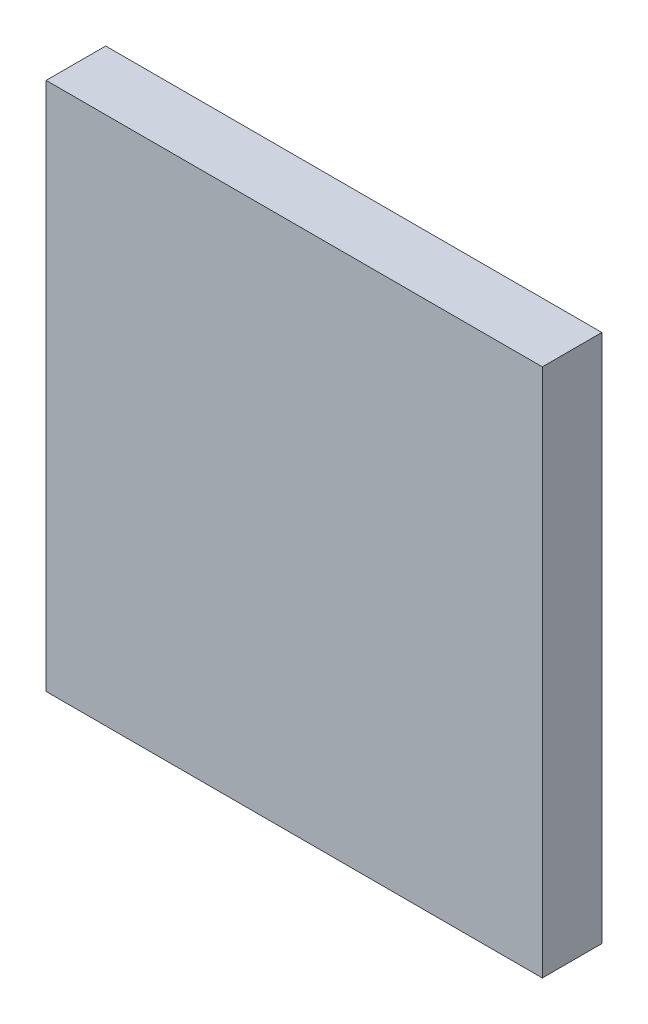
ISO-10303-21;
HEADER;
FILE_DESCRIPTION(('STEP AP214'),'2;1');
FILE_NAME('part.step','',(''),(''),'','','');
FILE_SCHEMA(('AUTOMOTIVE_DESIGN { 1 0 10303 214 1 1 1 1 }'));
ENDSEC;
DATA;
#1=APPLICATION_CONTEXT('core data for automotive mechanical design processes');
#2=APPLICATION_PROTOCOL_DEFINITION('international standard','automotive_design',2000,#1);
#3=PRODUCT_CONTEXT('',#1,'mechanical');
#4=PRODUCT('Part','Part','',(#3));
#5=PRODUCT_RELATED_PRODUCT_CATEGORY('part','',(#4));
#6=PRODUCT_DEFINITION_FORMATION('','',#4);
#7=PRODUCT_DEFINITION_CONTEXT('part definition',#1,'design');
#8=PRODUCT_DEFINITION('design','',#6,#7);
#9=PRODUCT_DEFINITION_SHAPE('','',#8);
#10=(LENGTH_UNIT() NAMED_UNIT(*) SI_UNIT(.MILLI.,.METRE.));
#11=(NAMED_UNIT(*) PLANE_ANGLE_UNIT() SI_UNIT($,.RADIAN.));
#12=(NAMED_UNIT(*) SI_UNIT($,.STERADIAN.) SOLID_ANGLE_UNIT());
#13=UNCERTAINTY_MEASURE_WITH_UNIT(LENGTH_MEASURE(1.E-05),#10,'distance_accuracy_value','');
#14=(GEOMETRIC_REPRESENTATION_CONTEXT(3) GLOBAL_UNCERTAINTY_ASSIGNED_CONTEXT((#13)) GLOBAL_UNIT_ASSIGNED_CONTEXT((#10,
#11,#12)) REPRESENTATION_CONTEXT('',''));
#15=CARTESIAN_POINT('',(0.,0.,0.));
#16=DIRECTION('',(0.,0.,1.));
#17=DIRECTION('',(1.,0.,0.));
#18=AXIS2_PLACEMENT_3D('',#15,#16,#17);
#19=CARTESIAN_POINT('',(0.,0.,0.17999964));
#20=DIRECTION('',(0.,0.,1.));
#21=DIRECTION('',(1.,0.,0.));
#22=AXIS2_PLACEMENT_3D('',#19,#20,#21);
#23=PLANE('',#22);
#24=DIRECTION('',(0.,1.,0.));
#25=VECTOR('',#24,1.);
#26=CARTESIAN_POINT('',(0.75000104,-0.80000094,0.17999964));
#27=LINE('',#26,#25);
#28=CARTESIAN_POINT('',(0.75000104,-0.80000094,0.17999964));
#29=VERTEX_POINT('',#28);
#30=CARTESIAN_POINT('',(0.75000104,0.80000094,0.17999964));
#31=VERTEX_POINT('',#30);
#32=EDGE_CURVE('E92',#29,#31,#27,.T.);
#33=ORIENTED_EDGE('',*,*,#32,.T.);
#34=DIRECTION('',(-1.,0.,0.));
#35=VECTOR('',#34,1.);
#36=CARTESIAN_POINT('',(0.75000104,0.80000094,0.17999964));
#37=LINE('',#36,#35);
#38=CARTESIAN_POINT('',(-0.75000104,0.80000094,0.17999964));
#39=VERTEX_POINT('',#38);
#40=EDGE_CURVE('E65',#31,#39,#37,.T.);
#41=ORIENTED_EDGE('',*,*,#40,.T.);
#42=DIRECTION('',(0.,-1.,0.));
#43=VECTOR('',#42,1.);
#44=CARTESIAN_POINT('',(-0.75000104,0.80000094,0.17999964));
#45=LINE('',#44,#43);
#46=CARTESIAN_POINT('',(-0.75000104,-0.80000094,0.17999964));
#47=VERTEX_POINT('',#46);
#48=EDGE_CURVE('E84',#39,#47,#45,.T.);
#49=ORIENTED_EDGE('',*,*,#48,.T.);
#50=DIRECTION('',(1.,0.,0.));
#51=VECTOR('',#50,1.);
#52=CARTESIAN_POINT('',(-0.75000104,-0.80000094,0.17999964));
#53=LINE('',#52,#51);
#54=EDGE_CURVE('E11',#47,#29,#53,.T.);
#55=ORIENTED_EDGE('',*,*,#54,.T.);
#56=EDGE_LOOP('',(#33,#41,#49,#55));
#57=FACE_BOUND('',#56,.T.);
#58=ADVANCED_FACE('F16',(#57),#23,.T.);
#59=CARTESIAN_POINT('',(0.,0.,0.));
#60=DIRECTION('',(0.,0.,1.));
#61=DIRECTION('',(1.,0.,0.));
#62=AXIS2_PLACEMENT_3D('',#59,#60,#61);
#63=PLANE('',#62);
#64=DIRECTION('',(0.,1.,0.));
#65=VECTOR('',#64,1.);
#66=CARTESIAN_POINT('',(0.75000104,-0.80000094,0.));
#67=LINE('',#66,#65);
#68=CARTESIAN_POINT('',(0.75000104,-0.80000094,0.));
#69=VERTEX_POINT('',#68);
#70=CARTESIAN_POINT('',(0.75000104,0.80000094,0.));
#71=VERTEX_POINT('',#70);
#72=EDGE_CURVE('E104',#69,#71,#67,.T.);
#73=ORIENTED_EDGE('',*,*,#72,.F.);
#74=DIRECTION('',(1.,0.,0.));
#75=VECTOR('',#74,1.);
#76=CARTESIAN_POINT('',(-0.75000104,-0.80000094,0.));
#77=LINE('',#76,#75);
#78=CARTESIAN_POINT('',(-0.75000104,-0.80000094,0.));
#79=VERTEX_POINT('',#78);
#80=EDGE_CURVE('E27',#79,#69,#77,.T.);
#81=ORIENTED_EDGE('',*,*,#80,.F.);
#82=DIRECTION('',(0.,-1.,0.));
#83=VECTOR('',#82,1.);
#84=CARTESIAN_POINT('',(-0.75000104,0.80000094,0.));
#85=LINE('',#84,#83);
#86=CARTESIAN_POINT('',(-0.75000104,0.80000094,0.));
#87=VERTEX_POINT('',#86);
#88=EDGE_CURVE('E72',#87,#79,#85,.T.);
#89=ORIENTED_EDGE('',*,*,#88,.F.);
#90=DIRECTION('',(-1.,0.,0.));
#91=VECTOR('',#90,1.);
#92=CARTESIAN_POINT('',(0.75000104,0.80000094,0.));
#93=LINE('',#92,#91);
#94=EDGE_CURVE('E77',#71,#87,#93,.T.);
#95=ORIENTED_EDGE('',*,*,#94,.F.);
#96=EDGE_LOOP('',(#73,#81,#89,#95));
#97=FACE_BOUND('',#96,.T.);
#98=ADVANCED_FACE('F75',(#97),#63,.F.);
#99=CARTESIAN_POINT('',(-0.75000104,-0.80000094,0.));
#100=DIRECTION('',(0.,1.,0.));
#101=DIRECTION('',(1.,0.,0.));
#102=AXIS2_PLACEMENT_3D('',#99,#100,#101);
#103=PLANE('',#102);
#104=DIRECTION('',(0.,0.,1.));
#105=VECTOR('',#104,1.);
#106=CARTESIAN_POINT('',(-0.75000104,-0.80000094,0.));
#107=LINE('',#106,#105);
#108=EDGE_CURVE('E82',#79,#47,#107,.T.);
#109=ORIENTED_EDGE('',*,*,#108,.F.);
#110=ORIENTED_EDGE('',*,*,#80,.T.);
#111=DIRECTION('',(0.,0.,1.));
#112=VECTOR('',#111,1.);
#113=CARTESIAN_POINT('',(0.75000104,-0.80000094,0.));
#114=LINE('',#113,#112);
#115=EDGE_CURVE('E20',#69,#29,#114,.T.);
#116=ORIENTED_EDGE('',*,*,#115,.T.);
#117=ORIENTED_EDGE('',*,*,#54,.F.);
#118=EDGE_LOOP('',(#109,#110,#116,#117));
#119=FACE_BOUND('',#118,.T.);
#120=ADVANCED_FACE('F116',(#119),#103,.F.);
#121=CARTESIAN_POINT('',(-0.75000104,0.80000094,0.));
#122=DIRECTION('',(1.,0.,0.));
#123=DIRECTION('',(0.,1.,0.));
#124=AXIS2_PLACEMENT_3D('',#121,#122,#123);
#125=PLANE('',#124);
#126=DIRECTION('',(0.,0.,1.));
#127=VECTOR('',#126,1.);
#128=CARTESIAN_POINT('',(-0.75000104,0.80000094,0.));
#129=LINE('',#128,#127);
#130=EDGE_CURVE('E83',#87,#39,#129,.T.);
#131=ORIENTED_EDGE('',*,*,#130,.F.);
#132=ORIENTED_EDGE('',*,*,#88,.T.);
#133=ORIENTED_EDGE('',*,*,#108,.T.);
#134=ORIENTED_EDGE('',*,*,#48,.F.);
#135=EDGE_LOOP('',(#131,#132,#133,#134));
#136=FACE_BOUND('',#135,.T.);
#137=ADVANCED_FACE('F18',(#136),#125,.F.);
#138=CARTESIAN_POINT('',(0.75000104,0.80000094,0.));
#139=DIRECTION('',(0.,-1.,0.));
#140=DIRECTION('',(0.,0.,-1.));
#141=AXIS2_PLACEMENT_3D('',#138,#139,#140);
#142=PLANE('',#141);
#143=DIRECTION('',(0.,0.,1.));
#144=VECTOR('',#143,1.);
#145=CARTESIAN_POINT('',(0.75000104,0.80000094,0.));
#146=LINE('',#145,#144);
#147=EDGE_CURVE('E89',#71,#31,#146,.T.);
#148=ORIENTED_EDGE('',*,*,#147,.F.);
#149=ORIENTED_EDGE('',*,*,#94,.T.);
#150=ORIENTED_EDGE('',*,*,#130,.T.);
#151=ORIENTED_EDGE('',*,*,#40,.F.);
#152=EDGE_LOOP('',(#148,#149,#150,#151));
#153=FACE_BOUND('',#152,.T.);
#154=ADVANCED_FACE('F87',(#153),#142,.F.);
#155=CARTESIAN_POINT('',(0.75000104,-0.80000094,0.));
#156=DIRECTION('',(-1.,0.,0.));
#157=DIRECTION('',(0.,0.,1.));
#158=AXIS2_PLACEMENT_3D('',#155,#156,#157);
#159=PLANE('',#158);
#160=ORIENTED_EDGE('',*,*,#115,.F.);
#161=ORIENTED_EDGE('',*,*,#72,.T.);
#162=ORIENTED_EDGE('',*,*,#147,.T.);
#163=ORIENTED_EDGE('',*,*,#32,.F.);
#164=EDGE_LOOP('',(#160,#161,#162,#163));
#165=FACE_BOUND('',#164,.T.);
#166=ADVANCED_FACE('F119',(#165),#159,.F.);
#167=CLOSED_SHELL('',(#58,#98,#120,#137,#154,#166));
#168=MANIFOLD_SOLID_BREP('B1',#167);
#169=ADVANCED_BREP_SHAPE_REPRESENTATION('',(#18,#168),#14);
#170=SHAPE_DEFINITION_REPRESENTATION(#9,#169);
ENDSEC;
END-ISO-10303-21;
